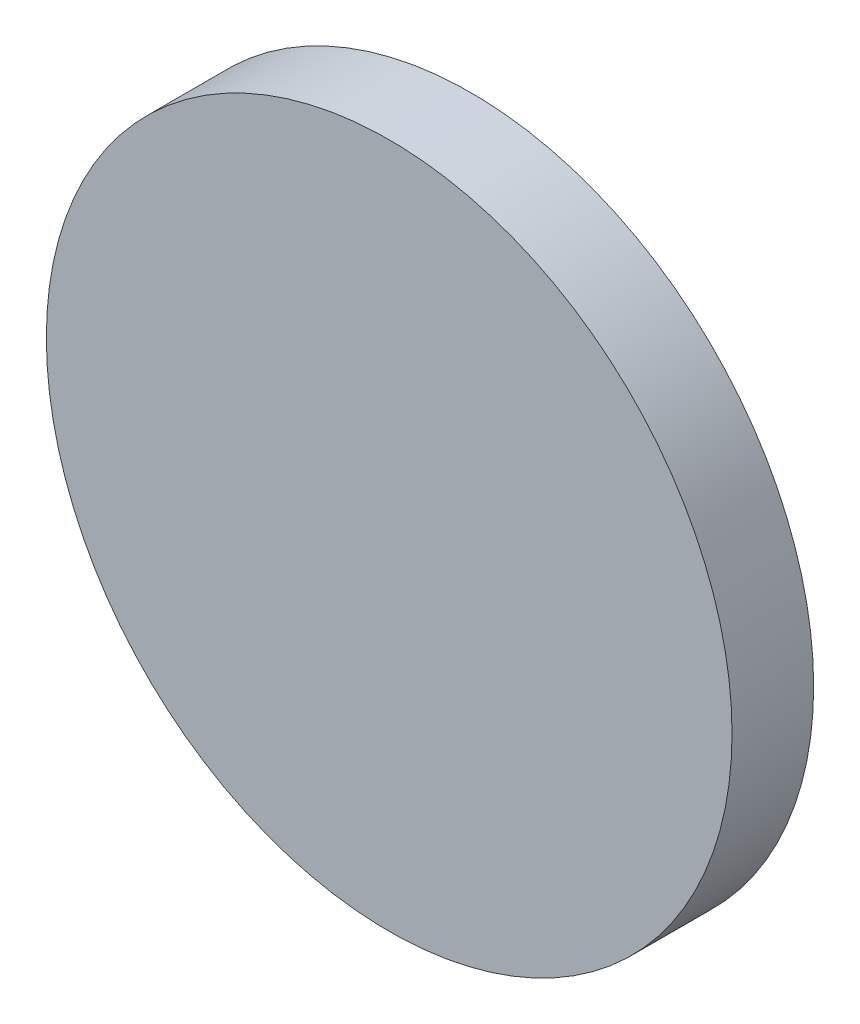
ISO-10303-21;
HEADER;
FILE_DESCRIPTION(('STEP AP214'),'2;1');
FILE_NAME('part.step','',(''),(''),'','','');
FILE_SCHEMA(('AUTOMOTIVE_DESIGN { 1 0 10303 214 1 1 1 1 }'));
ENDSEC;
DATA;
#1=APPLICATION_CONTEXT('core data for automotive mechanical design processes');
#2=APPLICATION_PROTOCOL_DEFINITION('international standard','automotive_design',2000,#1);
#3=PRODUCT_CONTEXT('',#1,'mechanical');
#4=PRODUCT('Part','Part','',(#3));
#5=PRODUCT_RELATED_PRODUCT_CATEGORY('part','',(#4));
#6=PRODUCT_DEFINITION_FORMATION('','',#4);
#7=PRODUCT_DEFINITION_CONTEXT('part definition',#1,'design');
#8=PRODUCT_DEFINITION('design','',#6,#7);
#9=PRODUCT_DEFINITION_SHAPE('','',#8);
#10=(LENGTH_UNIT() NAMED_UNIT(*) SI_UNIT(.MILLI.,.METRE.));
#11=(NAMED_UNIT(*) PLANE_ANGLE_UNIT() SI_UNIT($,.RADIAN.));
#12=(NAMED_UNIT(*) SI_UNIT($,.STERADIAN.) SOLID_ANGLE_UNIT());
#13=UNCERTAINTY_MEASURE_WITH_UNIT(LENGTH_MEASURE(1.E-05),#10,'distance_accuracy_value','');
#14=(GEOMETRIC_REPRESENTATION_CONTEXT(3) GLOBAL_UNCERTAINTY_ASSIGNED_CONTEXT((#13)) GLOBAL_UNIT_ASSIGNED_CONTEXT((#10,
#11,#12)) REPRESENTATION_CONTEXT('',''));
#15=CARTESIAN_POINT('',(0.,0.,0.));
#16=DIRECTION('',(0.,0.,1.));
#17=DIRECTION('',(1.,0.,0.));
#18=AXIS2_PLACEMENT_3D('',#15,#16,#17);
#19=CARTESIAN_POINT('',(0.,0.,0.5));
#20=DIRECTION('',(0.,0.,1.));
#21=DIRECTION('',(1.,0.,0.));
#22=AXIS2_PLACEMENT_3D('',#19,#20,#21);
#23=PLANE('',#22);
#24=CARTESIAN_POINT('',(0.,0.,0.5));
#25=DIRECTION('',(0.,0.,1.));
#26=DIRECTION('',(-1.,0.,0.));
#27=AXIS2_PLACEMENT_3D('',#24,#25,#26);
#28=CIRCLE('',#27,2.1);
#29=CARTESIAN_POINT('',(2.1,0.,0.5));
#30=VERTEX_POINT('',#29);
#31=EDGE_CURVE('E19',#30,#30,#28,.T.);
#32=ORIENTED_EDGE('',*,*,#31,.T.);
#33=EDGE_LOOP('',(#32));
#34=FACE_BOUND('',#33,.T.);
#35=ADVANCED_FACE('F16',(#34),#23,.T.);
#36=CARTESIAN_POINT('',(0.,0.,0.));
#37=DIRECTION('',(0.,0.,1.));
#38=DIRECTION('',(1.,0.,0.));
#39=AXIS2_PLACEMENT_3D('',#36,#37,#38);
#40=PLANE('',#39);
#41=CARTESIAN_POINT('',(0.,0.,0.));
#42=DIRECTION('',(0.,0.,-1.));
#43=DIRECTION('',(-1.,0.,0.));
#44=AXIS2_PLACEMENT_3D('',#41,#42,#43);
#45=CIRCLE('',#44,2.1);
#46=CARTESIAN_POINT('',(2.1,0.,0.));
#47=VERTEX_POINT('',#46);
#48=EDGE_CURVE('E10',#47,#47,#45,.T.);
#49=ORIENTED_EDGE('',*,*,#48,.T.);
#50=EDGE_LOOP('',(#49));
#51=FACE_BOUND('',#50,.T.);
#52=ADVANCED_FACE('F64',(#51),#40,.F.);
#53=CARTESIAN_POINT('',(0.,0.,0.));
#54=DIRECTION('',(0.,0.,1.));
#55=DIRECTION('',(-1.,0.,0.));
#56=AXIS2_PLACEMENT_3D('',#53,#54,#55);
#57=CYLINDRICAL_SURFACE('',#56,2.1);
#58=ORIENTED_EDGE('',*,*,#31,.F.);
#59=DIRECTION('',(0.,0.,-1.));
#60=VECTOR('',#59,1.);
#61=CARTESIAN_POINT('',(2.1,0.,0.));
#62=LINE('',#61,#60);
#63=EDGE_CURVE('E26',#30,#47,#62,.T.);
#64=ORIENTED_EDGE('',*,*,#63,.T.);
#65=ORIENTED_EDGE('',*,*,#48,.F.);
#66=ORIENTED_EDGE('',*,*,#63,.F.);
#67=EDGE_LOOP('',(#58,#64,#65,#66));
#68=FACE_BOUND('',#67,.T.);
#69=ADVANCED_FACE('F42',(#68),#57,.T.);
#70=CLOSED_SHELL('',(#35,#52,#69));
#71=MANIFOLD_SOLID_BREP('B1',#70);
#72=ADVANCED_BREP_SHAPE_REPRESENTATION('',(#18,#71),#14);
#73=SHAPE_DEFINITION_REPRESENTATION(#9,#72);
ENDSEC;
END-ISO-10303-21;
